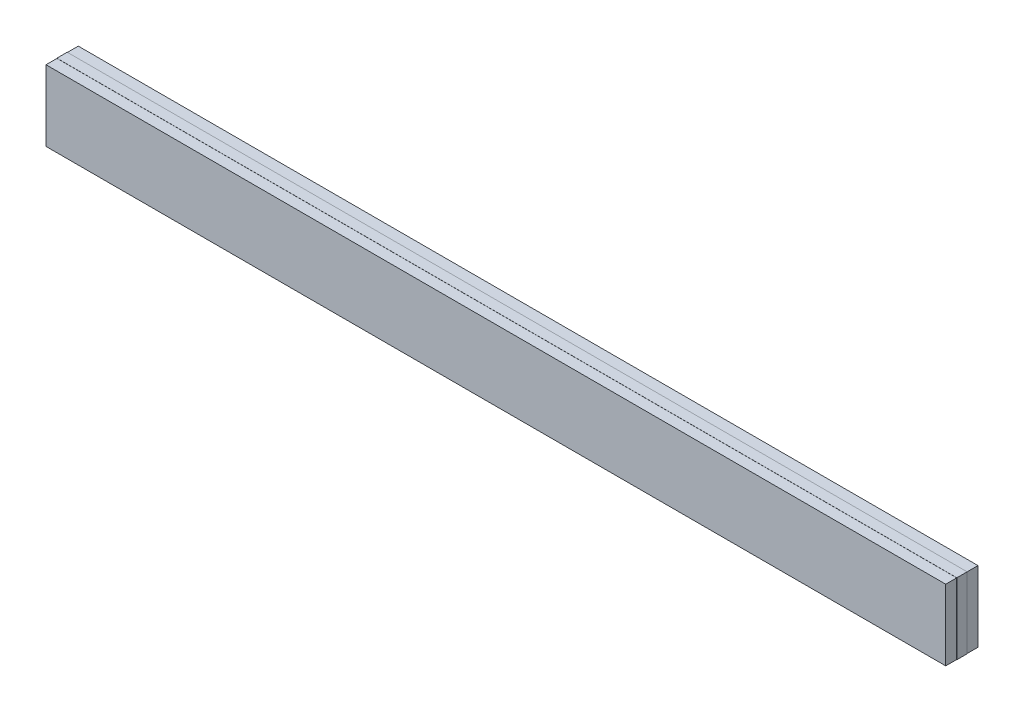
ISO-10303-21;
HEADER;
FILE_DESCRIPTION(('STEP AP214'),'2;1');
FILE_NAME('part.step','',(''),(''),'','','');
FILE_SCHEMA(('AUTOMOTIVE_DESIGN { 1 0 10303 214 1 1 1 1 }'));
ENDSEC;
DATA;
#1=APPLICATION_CONTEXT('core data for automotive mechanical design processes');
#2=APPLICATION_PROTOCOL_DEFINITION('international standard','automotive_design',2000,#1);
#3=PRODUCT_CONTEXT('',#1,'mechanical');
#4=PRODUCT('Part','Part','',(#3));
#5=PRODUCT_RELATED_PRODUCT_CATEGORY('part','',(#4));
#6=PRODUCT_DEFINITION_FORMATION('','',#4);
#7=PRODUCT_DEFINITION_CONTEXT('part definition',#1,'design');
#8=PRODUCT_DEFINITION('design','',#6,#7);
#9=PRODUCT_DEFINITION_SHAPE('','',#8);
#10=(LENGTH_UNIT() NAMED_UNIT(*) SI_UNIT(.MILLI.,.METRE.));
#11=(NAMED_UNIT(*) PLANE_ANGLE_UNIT() SI_UNIT($,.RADIAN.));
#12=(NAMED_UNIT(*) SI_UNIT($,.STERADIAN.) SOLID_ANGLE_UNIT());
#13=UNCERTAINTY_MEASURE_WITH_UNIT(LENGTH_MEASURE(1.E-05),#10,'distance_accuracy_value','');
#14=(GEOMETRIC_REPRESENTATION_CONTEXT(3) GLOBAL_UNCERTAINTY_ASSIGNED_CONTEXT((#13)) GLOBAL_UNIT_ASSIGNED_CONTEXT((#10,
#11,#12)) REPRESENTATION_CONTEXT('',''));
#15=CARTESIAN_POINT('',(0.,0.,0.));
#16=DIRECTION('',(0.,0.,1.));
#17=DIRECTION('',(1.,0.,0.));
#18=AXIS2_PLACEMENT_3D('',#15,#16,#17);
#19=CARTESIAN_POINT('',(0.,0.,-1.25));
#20=DIRECTION('',(0.,0.,-1.));
#21=DIRECTION('',(-1.,0.,0.));
#22=AXIS2_PLACEMENT_3D('',#19,#20,#21);
#23=PLANE('',#22);
#24=DIRECTION('',(1.,0.,0.));
#25=VECTOR('',#24,1.);
#26=CARTESIAN_POINT('',(34.84,-2.74,-1.25));
#27=LINE('',#26,#25);
#28=CARTESIAN_POINT('',(34.84,-2.74,-1.25));
#29=VERTEX_POINT('',#28);
#30=CARTESIAN_POINT('',(-34.84,-2.74,-1.25));
#31=VERTEX_POINT('',#30);
#32=EDGE_CURVE('E103',#29,#31,#27,.F.);
#33=ORIENTED_EDGE('',*,*,#32,.T.);
#34=DIRECTION('',(0.,1.,0.));
#35=VECTOR('',#34,1.);
#36=CARTESIAN_POINT('',(-34.84,-2.74,-1.25));
#37=LINE('',#36,#35);
#38=CARTESIAN_POINT('',(-34.84,2.74,-1.25));
#39=VERTEX_POINT('',#38);
#40=EDGE_CURVE('E123',#31,#39,#37,.T.);
#41=ORIENTED_EDGE('',*,*,#40,.T.);
#42=DIRECTION('',(1.,0.,0.));
#43=VECTOR('',#42,1.);
#44=CARTESIAN_POINT('',(-34.84,2.74,-1.25));
#45=LINE('',#44,#43);
#46=CARTESIAN_POINT('',(34.84,2.74,-1.25));
#47=VERTEX_POINT('',#46);
#48=EDGE_CURVE('E108',#39,#47,#45,.T.);
#49=ORIENTED_EDGE('',*,*,#48,.T.);
#50=DIRECTION('',(0.,1.,0.));
#51=VECTOR('',#50,1.);
#52=CARTESIAN_POINT('',(34.84,2.74,-1.25));
#53=LINE('',#52,#51);
#54=EDGE_CURVE('E20',#47,#29,#53,.F.);
#55=ORIENTED_EDGE('',*,*,#54,.T.);
#56=EDGE_LOOP('',(#33,#41,#49,#55));
#57=FACE_BOUND('',#56,.T.);
#58=ADVANCED_FACE('F17',(#57),#23,.T.);
#59=CARTESIAN_POINT('',(34.84,2.74,-1.25));
#60=DIRECTION('',(-1.,0.,0.));
#61=DIRECTION('',(0.,0.,1.));
#62=AXIS2_PLACEMENT_3D('',#59,#60,#61);
#63=PLANE('',#62);
#64=DIRECTION('',(0.,0.,1.));
#65=VECTOR('',#64,1.);
#66=CARTESIAN_POINT('',(34.84,-2.74,-1.25));
#67=LINE('',#66,#65);
#68=CARTESIAN_POINT('',(34.84,-2.74,-0.4));
#69=VERTEX_POINT('',#68);
#70=EDGE_CURVE('E111',#69,#29,#67,.F.);
#71=ORIENTED_EDGE('',*,*,#70,.T.);
#72=ORIENTED_EDGE('',*,*,#54,.F.);
#73=DIRECTION('',(0.,0.,-1.));
#74=VECTOR('',#73,1.);
#75=CARTESIAN_POINT('',(34.84,2.74,-1.25));
#76=LINE('',#75,#74);
#77=CARTESIAN_POINT('',(34.84,2.74,-0.4));
#78=VERTEX_POINT('',#77);
#79=EDGE_CURVE('E131',#47,#78,#76,.F.);
#80=ORIENTED_EDGE('',*,*,#79,.T.);
#81=DIRECTION('',(0.,1.,0.));
#82=VECTOR('',#81,1.);
#83=CARTESIAN_POINT('',(34.84,0.,-0.4));
#84=LINE('',#83,#82);
#85=EDGE_CURVE('E115',#78,#69,#84,.F.);
#86=ORIENTED_EDGE('',*,*,#85,.T.);
#87=EDGE_LOOP('',(#71,#72,#80,#86));
#88=FACE_BOUND('',#87,.T.);
#89=ADVANCED_FACE('F113',(#88),#63,.F.);
#90=CARTESIAN_POINT('',(34.84,-2.74,-1.25));
#91=DIRECTION('',(0.,1.,0.));
#92=DIRECTION('',(0.,0.,1.));
#93=AXIS2_PLACEMENT_3D('',#90,#91,#92);
#94=PLANE('',#93);
#95=DIRECTION('',(0.,0.,-1.));
#96=VECTOR('',#95,1.);
#97=CARTESIAN_POINT('',(-34.84,-2.74,-1.25));
#98=LINE('',#97,#96);
#99=CARTESIAN_POINT('',(-34.84,-2.74,-0.4));
#100=VERTEX_POINT('',#99);
#101=EDGE_CURVE('E120',#100,#31,#98,.T.);
#102=ORIENTED_EDGE('',*,*,#101,.T.);
#103=ORIENTED_EDGE('',*,*,#32,.F.);
#104=ORIENTED_EDGE('',*,*,#70,.F.);
#105=DIRECTION('',(1.,0.,0.));
#106=VECTOR('',#105,1.);
#107=CARTESIAN_POINT('',(0.,-2.74,-0.4));
#108=LINE('',#107,#106);
#109=EDGE_CURVE('E134',#69,#100,#108,.F.);
#110=ORIENTED_EDGE('',*,*,#109,.T.);
#111=EDGE_LOOP('',(#102,#103,#104,#110));
#112=FACE_BOUND('',#111,.T.);
#113=ADVANCED_FACE('F118',(#112),#94,.F.);
#114=CARTESIAN_POINT('',(-34.84,-2.74,-1.25));
#115=DIRECTION('',(1.,0.,0.));
#116=DIRECTION('',(0.,0.,-1.));
#117=AXIS2_PLACEMENT_3D('',#114,#115,#116);
#118=PLANE('',#117);
#119=DIRECTION('',(0.,0.,-1.));
#120=VECTOR('',#119,1.);
#121=CARTESIAN_POINT('',(-34.84,2.74,-1.25));
#122=LINE('',#121,#120);
#123=CARTESIAN_POINT('',(-34.84,2.74,-0.4));
#124=VERTEX_POINT('',#123);
#125=EDGE_CURVE('E127',#124,#39,#122,.T.);
#126=ORIENTED_EDGE('',*,*,#125,.T.);
#127=ORIENTED_EDGE('',*,*,#40,.F.);
#128=ORIENTED_EDGE('',*,*,#101,.F.);
#129=DIRECTION('',(0.,1.,0.));
#130=VECTOR('',#129,1.);
#131=CARTESIAN_POINT('',(-34.84,0.,-0.4));
#132=LINE('',#131,#130);
#133=EDGE_CURVE('E136',#100,#124,#132,.T.);
#134=ORIENTED_EDGE('',*,*,#133,.T.);
#135=EDGE_LOOP('',(#126,#127,#128,#134));
#136=FACE_BOUND('',#135,.T.);
#137=ADVANCED_FACE('F323',(#136),#118,.F.);
#138=CARTESIAN_POINT('',(-34.84,2.74,-1.25));
#139=DIRECTION('',(0.,-1.,0.));
#140=DIRECTION('',(0.,0.,-1.));
#141=AXIS2_PLACEMENT_3D('',#138,#139,#140);
#142=PLANE('',#141);
#143=ORIENTED_EDGE('',*,*,#79,.F.);
#144=ORIENTED_EDGE('',*,*,#48,.F.);
#145=ORIENTED_EDGE('',*,*,#125,.F.);
#146=DIRECTION('',(1.,0.,0.));
#147=VECTOR('',#146,1.);
#148=CARTESIAN_POINT('',(0.,2.74,-0.4));
#149=LINE('',#148,#147);
#150=EDGE_CURVE('E138',#124,#78,#149,.T.);
#151=ORIENTED_EDGE('',*,*,#150,.T.);
#152=EDGE_LOOP('',(#143,#144,#145,#151));
#153=FACE_BOUND('',#152,.T.);
#154=ADVANCED_FACE('F314',(#153),#142,.F.);
#155=CARTESIAN_POINT('',(0.,0.,-0.4));
#156=DIRECTION('',(0.,0.,1.));
#157=DIRECTION('',(1.,0.,0.));
#158=AXIS2_PLACEMENT_3D('',#155,#156,#157);
#159=PLANE('',#158);
#160=ORIENTED_EDGE('',*,*,#133,.F.);
#161=ORIENTED_EDGE('',*,*,#109,.F.);
#162=ORIENTED_EDGE('',*,*,#85,.F.);
#163=ORIENTED_EDGE('',*,*,#150,.F.);
#164=EDGE_LOOP('',(#160,#161,#162,#163));
#165=FACE_BOUND('',#164,.T.);
#166=DIRECTION('',(1.,0.,0.));
#167=VECTOR('',#166,1.);
#168=CARTESIAN_POINT('',(-34.85,-2.75,-0.4));
#169=LINE('',#168,#167);
#170=CARTESIAN_POINT('',(34.85,-2.75,-0.4));
#171=VERTEX_POINT('',#170);
#172=CARTESIAN_POINT('',(-34.85,-2.75,-0.4));
#173=VERTEX_POINT('',#172);
#174=EDGE_CURVE('E158',#171,#173,#169,.F.);
#175=ORIENTED_EDGE('',*,*,#174,.T.);
#176=DIRECTION('',(0.,1.,0.));
#177=VECTOR('',#176,1.);
#178=CARTESIAN_POINT('',(-34.85,2.75,-0.4));
#179=LINE('',#178,#177);
#180=CARTESIAN_POINT('',(-34.85,2.75,-0.4));
#181=VERTEX_POINT('',#180);
#182=EDGE_CURVE('E150',#173,#181,#179,.T.);
#183=ORIENTED_EDGE('',*,*,#182,.T.);
#184=DIRECTION('',(1.,0.,0.));
#185=VECTOR('',#184,1.);
#186=CARTESIAN_POINT('',(-34.85,2.75,-0.4));
#187=LINE('',#186,#185);
#188=CARTESIAN_POINT('',(34.85,2.75,-0.4));
#189=VERTEX_POINT('',#188);
#190=EDGE_CURVE('E145',#181,#189,#187,.T.);
#191=ORIENTED_EDGE('',*,*,#190,.T.);
#192=DIRECTION('',(0.,1.,0.));
#193=VECTOR('',#192,1.);
#194=CARTESIAN_POINT('',(34.85,2.75,-0.4));
#195=LINE('',#194,#193);
#196=EDGE_CURVE('E141',#189,#171,#195,.F.);
#197=ORIENTED_EDGE('',*,*,#196,.T.);
#198=EDGE_LOOP('',(#175,#183,#191,#197));
#199=FACE_BOUND('',#198,.T.);
#200=ADVANCED_FACE('F305',(#165,#199),#159,.F.);
#201=CARTESIAN_POINT('',(34.85,2.75,0.4));
#202=DIRECTION('',(-1.,0.,0.));
#203=DIRECTION('',(0.,0.,1.));
#204=AXIS2_PLACEMENT_3D('',#201,#202,#203);
#205=PLANE('',#204);
#206=DIRECTION('',(0.,0.,-1.));
#207=VECTOR('',#206,1.);
#208=CARTESIAN_POINT('',(34.85,2.75,0.4));
#209=LINE('',#208,#207);
#210=CARTESIAN_POINT('',(34.85,2.75,0.4));
#211=VERTEX_POINT('',#210);
#212=EDGE_CURVE('E143',#189,#211,#209,.F.);
#213=ORIENTED_EDGE('',*,*,#212,.T.);
#214=DIRECTION('',(0.,1.,0.));
#215=VECTOR('',#214,1.);
#216=CARTESIAN_POINT('',(34.85,0.,0.4));
#217=LINE('',#216,#215);
#218=CARTESIAN_POINT('',(34.85,-2.75,0.4));
#219=VERTEX_POINT('',#218);
#220=EDGE_CURVE('E161',#219,#211,#217,.T.);
#221=ORIENTED_EDGE('',*,*,#220,.F.);
#222=DIRECTION('',(0.,0.,1.));
#223=VECTOR('',#222,1.);
#224=CARTESIAN_POINT('',(34.85,-2.75,0.4));
#225=LINE('',#224,#223);
#226=EDGE_CURVE('E155',#219,#171,#225,.F.);
#227=ORIENTED_EDGE('',*,*,#226,.T.);
#228=ORIENTED_EDGE('',*,*,#196,.F.);
#229=EDGE_LOOP('',(#213,#221,#227,#228));
#230=FACE_BOUND('',#229,.T.);
#231=ADVANCED_FACE('F296',(#230),#205,.F.);
#232=CARTESIAN_POINT('',(-34.85,2.75,0.4));
#233=DIRECTION('',(0.,-1.,0.));
#234=DIRECTION('',(0.,0.,-1.));
#235=AXIS2_PLACEMENT_3D('',#232,#233,#234);
#236=PLANE('',#235);
#237=DIRECTION('',(0.,0.,-1.));
#238=VECTOR('',#237,1.);
#239=CARTESIAN_POINT('',(-34.85,2.75,0.4));
#240=LINE('',#239,#238);
#241=CARTESIAN_POINT('',(-34.85,2.75,0.4));
#242=VERTEX_POINT('',#241);
#243=EDGE_CURVE('E148',#181,#242,#240,.F.);
#244=ORIENTED_EDGE('',*,*,#243,.T.);
#245=DIRECTION('',(1.,0.,0.));
#246=VECTOR('',#245,1.);
#247=CARTESIAN_POINT('',(0.,2.75,0.4));
#248=LINE('',#247,#246);
#249=EDGE_CURVE('E164',#211,#242,#248,.F.);
#250=ORIENTED_EDGE('',*,*,#249,.F.);
#251=ORIENTED_EDGE('',*,*,#212,.F.);
#252=ORIENTED_EDGE('',*,*,#190,.F.);
#253=EDGE_LOOP('',(#244,#250,#251,#252));
#254=FACE_BOUND('',#253,.T.);
#255=ADVANCED_FACE('F287',(#254),#236,.F.);
#256=CARTESIAN_POINT('',(-34.85,2.75,0.4));
#257=DIRECTION('',(1.,0.,0.));
#258=DIRECTION('',(0.,0.,-1.));
#259=AXIS2_PLACEMENT_3D('',#256,#257,#258);
#260=PLANE('',#259);
#261=DIRECTION('',(0.,0.,1.));
#262=VECTOR('',#261,1.);
#263=CARTESIAN_POINT('',(-34.85,-2.75,0.4));
#264=LINE('',#263,#262);
#265=CARTESIAN_POINT('',(-34.85,-2.75,0.4));
#266=VERTEX_POINT('',#265);
#267=EDGE_CURVE('E153',#173,#266,#264,.T.);
#268=ORIENTED_EDGE('',*,*,#267,.T.);
#269=DIRECTION('',(0.,1.,0.));
#270=VECTOR('',#269,1.);
#271=CARTESIAN_POINT('',(-34.85,0.,0.4));
#272=LINE('',#271,#270);
#273=EDGE_CURVE('E167',#242,#266,#272,.F.);
#274=ORIENTED_EDGE('',*,*,#273,.F.);
#275=ORIENTED_EDGE('',*,*,#243,.F.);
#276=ORIENTED_EDGE('',*,*,#182,.F.);
#277=EDGE_LOOP('',(#268,#274,#275,#276));
#278=FACE_BOUND('',#277,.T.);
#279=ADVANCED_FACE('F278',(#278),#260,.F.);
#280=CARTESIAN_POINT('',(-34.85,-2.75,0.4));
#281=DIRECTION('',(0.,1.,0.));
#282=DIRECTION('',(0.,0.,1.));
#283=AXIS2_PLACEMENT_3D('',#280,#281,#282);
#284=PLANE('',#283);
#285=ORIENTED_EDGE('',*,*,#226,.F.);
#286=DIRECTION('',(1.,0.,0.));
#287=VECTOR('',#286,1.);
#288=CARTESIAN_POINT('',(0.,-2.75,0.4));
#289=LINE('',#288,#287);
#290=EDGE_CURVE('E170',#266,#219,#289,.T.);
#291=ORIENTED_EDGE('',*,*,#290,.F.);
#292=ORIENTED_EDGE('',*,*,#267,.F.);
#293=ORIENTED_EDGE('',*,*,#174,.F.);
#294=EDGE_LOOP('',(#285,#291,#292,#293));
#295=FACE_BOUND('',#294,.T.);
#296=ADVANCED_FACE('F224',(#295),#284,.F.);
#297=CARTESIAN_POINT('',(0.,0.,0.4));
#298=DIRECTION('',(0.,0.,1.));
#299=DIRECTION('',(1.,0.,0.));
#300=AXIS2_PLACEMENT_3D('',#297,#298,#299);
#301=PLANE('',#300);
#302=DIRECTION('',(0.,1.,0.));
#303=VECTOR('',#302,1.);
#304=CARTESIAN_POINT('',(-34.84,2.74,0.4));
#305=LINE('',#304,#303);
#306=CARTESIAN_POINT('',(-34.84,-2.74,0.4));
#307=VERTEX_POINT('',#306);
#308=CARTESIAN_POINT('',(-34.84,2.74,0.4));
#309=VERTEX_POINT('',#308);
#310=EDGE_CURVE('E189',#307,#309,#305,.T.);
#311=ORIENTED_EDGE('',*,*,#310,.T.);
#312=DIRECTION('',(1.,0.,0.));
#313=VECTOR('',#312,1.);
#314=CARTESIAN_POINT('',(34.84,2.74,0.4));
#315=LINE('',#314,#313);
#316=CARTESIAN_POINT('',(34.84,2.74,0.4));
#317=VERTEX_POINT('',#316);
#318=EDGE_CURVE('E182',#309,#317,#315,.T.);
#319=ORIENTED_EDGE('',*,*,#318,.T.);
#320=DIRECTION('',(0.,1.,0.));
#321=VECTOR('',#320,1.);
#322=CARTESIAN_POINT('',(34.84,-2.74,0.4));
#323=LINE('',#322,#321);
#324=CARTESIAN_POINT('',(34.84,-2.74,0.4));
#325=VERTEX_POINT('',#324);
#326=EDGE_CURVE('E177',#317,#325,#323,.F.);
#327=ORIENTED_EDGE('',*,*,#326,.T.);
#328=DIRECTION('',(1.,0.,0.));
#329=VECTOR('',#328,1.);
#330=CARTESIAN_POINT('',(-34.84,-2.74,0.4));
#331=LINE('',#330,#329);
#332=EDGE_CURVE('E173',#325,#307,#331,.F.);
#333=ORIENTED_EDGE('',*,*,#332,.T.);
#334=EDGE_LOOP('',(#311,#319,#327,#333));
#335=FACE_BOUND('',#334,.T.);
#336=ORIENTED_EDGE('',*,*,#273,.T.);
#337=ORIENTED_EDGE('',*,*,#290,.T.);
#338=ORIENTED_EDGE('',*,*,#220,.T.);
#339=ORIENTED_EDGE('',*,*,#249,.T.);
#340=EDGE_LOOP('',(#336,#337,#338,#339));
#341=FACE_BOUND('',#340,.T.);
#342=ADVANCED_FACE('F208',(#335,#341),#301,.T.);
#343=CARTESIAN_POINT('',(-34.84,-2.74,1.25));
#344=DIRECTION('',(0.,1.,0.));
#345=DIRECTION('',(0.,0.,1.));
#346=AXIS2_PLACEMENT_3D('',#343,#344,#345);
#347=PLANE('',#346);
#348=DIRECTION('',(0.,0.,1.));
#349=VECTOR('',#348,1.);
#350=CARTESIAN_POINT('',(34.84,-2.74,1.25));
#351=LINE('',#350,#349);
#352=CARTESIAN_POINT('',(34.84,-2.74,1.25));
#353=VERTEX_POINT('',#352);
#354=EDGE_CURVE('E175',#325,#353,#351,.T.);
#355=ORIENTED_EDGE('',*,*,#354,.T.);
#356=DIRECTION('',(1.,0.,0.));
#357=VECTOR('',#356,1.);
#358=CARTESIAN_POINT('',(0.,-2.74,1.25));
#359=LINE('',#358,#357);
#360=CARTESIAN_POINT('',(-34.84,-2.74,1.25));
#361=VERTEX_POINT('',#360);
#362=EDGE_CURVE('E192',#361,#353,#359,.T.);
#363=ORIENTED_EDGE('',*,*,#362,.F.);
#364=DIRECTION('',(0.,0.,-1.));
#365=VECTOR('',#364,1.);
#366=CARTESIAN_POINT('',(-34.84,-2.74,1.25));
#367=LINE('',#366,#365);
#368=EDGE_CURVE('E186',#361,#307,#367,.T.);
#369=ORIENTED_EDGE('',*,*,#368,.T.);
#370=ORIENTED_EDGE('',*,*,#332,.F.);
#371=EDGE_LOOP('',(#355,#363,#369,#370));
#372=FACE_BOUND('',#371,.T.);
#373=ADVANCED_FACE('F215',(#372),#347,.F.);
#374=CARTESIAN_POINT('',(34.84,-2.74,1.25));
#375=DIRECTION('',(-1.,0.,0.));
#376=DIRECTION('',(0.,0.,1.));
#377=AXIS2_PLACEMENT_3D('',#374,#375,#376);
#378=PLANE('',#377);
#379=DIRECTION('',(0.,0.,-1.));
#380=VECTOR('',#379,1.);
#381=CARTESIAN_POINT('',(34.84,2.74,1.25));
#382=LINE('',#381,#380);
#383=CARTESIAN_POINT('',(34.84,2.74,1.25));
#384=VERTEX_POINT('',#383);
#385=EDGE_CURVE('E180',#317,#384,#382,.F.);
#386=ORIENTED_EDGE('',*,*,#385,.T.);
#387=DIRECTION('',(0.,1.,0.));
#388=VECTOR('',#387,1.);
#389=CARTESIAN_POINT('',(34.84,0.,1.25));
#390=LINE('',#389,#388);
#391=EDGE_CURVE('E195',#353,#384,#390,.T.);
#392=ORIENTED_EDGE('',*,*,#391,.F.);
#393=ORIENTED_EDGE('',*,*,#354,.F.);
#394=ORIENTED_EDGE('',*,*,#326,.F.);
#395=EDGE_LOOP('',(#386,#392,#393,#394));
#396=FACE_BOUND('',#395,.T.);
#397=ADVANCED_FACE('F205',(#396),#378,.F.);
#398=CARTESIAN_POINT('',(34.84,2.74,1.25));
#399=DIRECTION('',(0.,-1.,0.));
#400=DIRECTION('',(0.,0.,-1.));
#401=AXIS2_PLACEMENT_3D('',#398,#399,#400);
#402=PLANE('',#401);
#403=DIRECTION('',(0.,0.,-1.));
#404=VECTOR('',#403,1.);
#405=CARTESIAN_POINT('',(-34.84,2.74,1.25));
#406=LINE('',#405,#404);
#407=CARTESIAN_POINT('',(-34.84,2.74,1.25));
#408=VERTEX_POINT('',#407);
#409=EDGE_CURVE('E35',#309,#408,#406,.F.);
#410=ORIENTED_EDGE('',*,*,#409,.T.);
#411=DIRECTION('',(1.,0.,0.));
#412=VECTOR('',#411,1.);
#413=CARTESIAN_POINT('',(0.,2.74,1.25));
#414=LINE('',#413,#412);
#415=EDGE_CURVE('E26',#384,#408,#414,.F.);
#416=ORIENTED_EDGE('',*,*,#415,.F.);
#417=ORIENTED_EDGE('',*,*,#385,.F.);
#418=ORIENTED_EDGE('',*,*,#318,.F.);
#419=EDGE_LOOP('',(#410,#416,#417,#418));
#420=FACE_BOUND('',#419,.T.);
#421=ADVANCED_FACE('F203',(#420),#402,.F.);
#422=CARTESIAN_POINT('',(-34.84,2.74,1.25));
#423=DIRECTION('',(1.,0.,0.));
#424=DIRECTION('',(0.,0.,-1.));
#425=AXIS2_PLACEMENT_3D('',#422,#423,#424);
#426=PLANE('',#425);
#427=ORIENTED_EDGE('',*,*,#368,.F.);
#428=DIRECTION('',(0.,1.,0.));
#429=VECTOR('',#428,1.);
#430=CARTESIAN_POINT('',(-34.84,0.,1.25));
#431=LINE('',#430,#429);
#432=EDGE_CURVE('E11',#408,#361,#431,.F.);
#433=ORIENTED_EDGE('',*,*,#432,.F.);
#434=ORIENTED_EDGE('',*,*,#409,.F.);
#435=ORIENTED_EDGE('',*,*,#310,.F.);
#436=EDGE_LOOP('',(#427,#433,#434,#435));
#437=FACE_BOUND('',#436,.T.);
#438=ADVANCED_FACE('F213',(#437),#426,.F.);
#439=CARTESIAN_POINT('',(0.,0.,1.25));
#440=DIRECTION('',(0.,0.,1.));
#441=DIRECTION('',(1.,0.,0.));
#442=AXIS2_PLACEMENT_3D('',#439,#440,#441);
#443=PLANE('',#442);
#444=ORIENTED_EDGE('',*,*,#415,.T.);
#445=ORIENTED_EDGE('',*,*,#432,.T.);
#446=ORIENTED_EDGE('',*,*,#362,.T.);
#447=ORIENTED_EDGE('',*,*,#391,.T.);
#448=EDGE_LOOP('',(#444,#445,#446,#447));
#449=FACE_BOUND('',#448,.T.);
#450=ADVANCED_FACE('F200',(#449),#443,.T.);
#451=CLOSED_SHELL('',(#58,#89,#113,#137,#154,#200,#231,#255,#279,#296,#342,#373,#397,#421,#438,#450));
#452=MANIFOLD_SOLID_BREP('B1',#451);
#453=ADVANCED_BREP_SHAPE_REPRESENTATION('',(#18,#452),#14);
#454=SHAPE_DEFINITION_REPRESENTATION(#9,#453);
ENDSEC;
END-ISO-10303-21;
